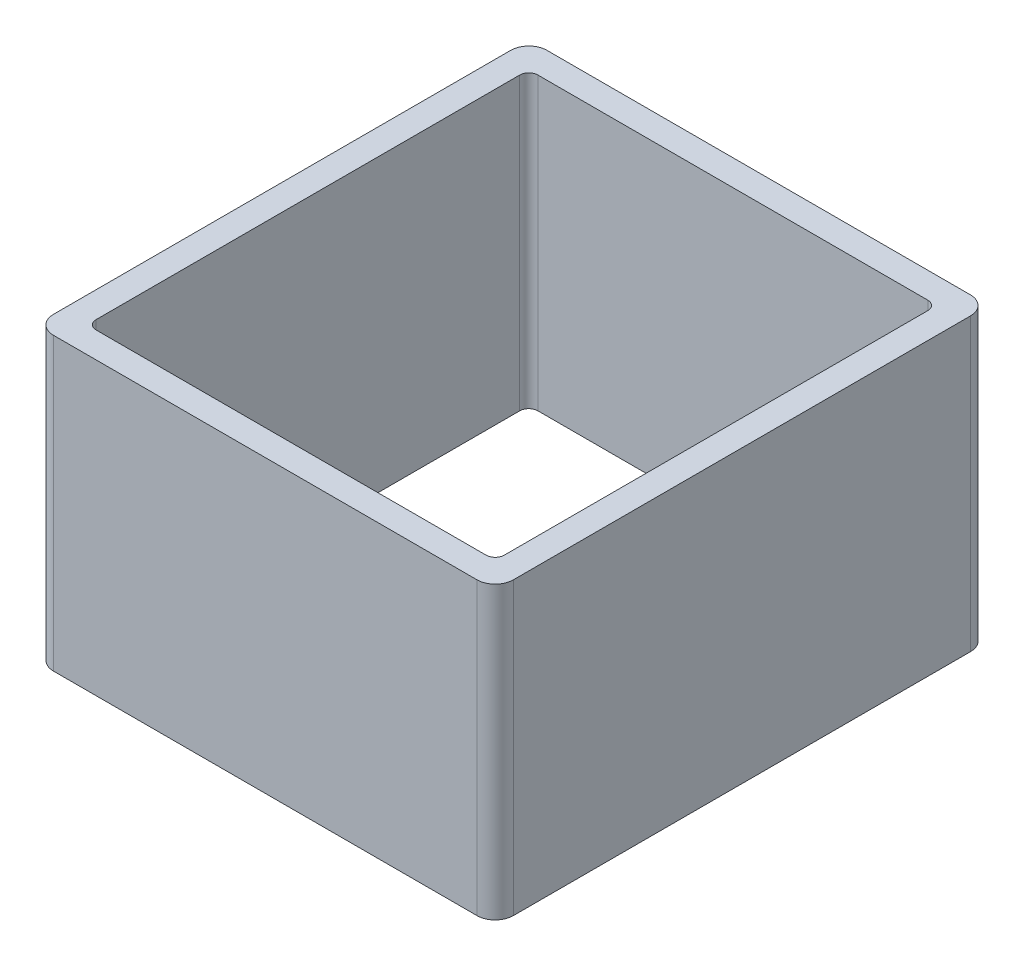
ISO-10303-21;
HEADER;
FILE_DESCRIPTION(('STEP AP214'),'2;1');
FILE_NAME('part.step','',(''),(''),'','','');
FILE_SCHEMA(('AUTOMOTIVE_DESIGN { 1 0 10303 214 1 1 1 1 }'));
ENDSEC;
DATA;
#1=APPLICATION_CONTEXT('core data for automotive mechanical design processes');
#2=APPLICATION_PROTOCOL_DEFINITION('international standard','automotive_design',2000,#1);
#3=PRODUCT_CONTEXT('',#1,'mechanical');
#4=PRODUCT('Part','Part','',(#3));
#5=PRODUCT_RELATED_PRODUCT_CATEGORY('part','',(#4));
#6=PRODUCT_DEFINITION_FORMATION('','',#4);
#7=PRODUCT_DEFINITION_CONTEXT('part definition',#1,'design');
#8=PRODUCT_DEFINITION('design','',#6,#7);
#9=PRODUCT_DEFINITION_SHAPE('','',#8);
#10=(LENGTH_UNIT() NAMED_UNIT(*) SI_UNIT(.MILLI.,.METRE.));
#11=(NAMED_UNIT(*) PLANE_ANGLE_UNIT() SI_UNIT($,.RADIAN.));
#12=(NAMED_UNIT(*) SI_UNIT($,.STERADIAN.) SOLID_ANGLE_UNIT());
#13=UNCERTAINTY_MEASURE_WITH_UNIT(LENGTH_MEASURE(1.E-05),#10,'distance_accuracy_value','');
#14=(GEOMETRIC_REPRESENTATION_CONTEXT(3) GLOBAL_UNCERTAINTY_ASSIGNED_CONTEXT((#13)) GLOBAL_UNIT_ASSIGNED_CONTEXT((#10,
#11,#12)) REPRESENTATION_CONTEXT('',''));
#15=CARTESIAN_POINT('',(0.,0.,0.));
#16=DIRECTION('',(0.,0.,1.));
#17=DIRECTION('',(1.,0.,0.));
#18=AXIS2_PLACEMENT_3D('',#15,#16,#17);
#19=CARTESIAN_POINT('',(0.,32.,0.));
#20=DIRECTION('',(0.,-1.,0.));
#21=DIRECTION('',(0.,0.,-1.));
#22=AXIS2_PLACEMENT_3D('',#19,#20,#21);
#23=PLANE('',#22);
#24=DIRECTION('',(0.,0.,-1.));
#25=VECTOR('',#24,1.);
#26=CARTESIAN_POINT('',(25.3,32.,27.15));
#27=LINE('',#26,#25);
#28=CARTESIAN_POINT('',(25.3,32.,25.15));
#29=VERTEX_POINT('',#28);
#30=CARTESIAN_POINT('',(25.3,32.,-25.15));
#31=VERTEX_POINT('',#30);
#32=EDGE_CURVE('E186',#29,#31,#27,.T.);
#33=ORIENTED_EDGE('',*,*,#32,.T.);
#34=CARTESIAN_POINT('',(23.3,32.,-25.15));
#35=DIRECTION('',(0.,-1.,0.));
#36=DIRECTION('',(0.,0.,-1.));
#37=AXIS2_PLACEMENT_3D('',#34,#35,#36);
#38=CIRCLE('',#37,2.);
#39=CARTESIAN_POINT('',(23.3,32.,-27.15));
#40=VERTEX_POINT('',#39);
#41=EDGE_CURVE('E202',#31,#40,#38,.F.);
#42=ORIENTED_EDGE('',*,*,#41,.T.);
#43=DIRECTION('',(-1.,0.,0.));
#44=VECTOR('',#43,1.);
#45=CARTESIAN_POINT('',(-25.3,32.,-27.15));
#46=LINE('',#45,#44);
#47=CARTESIAN_POINT('',(-23.3,32.,-27.15));
#48=VERTEX_POINT('',#47);
#49=EDGE_CURVE('E167',#40,#48,#46,.T.);
#50=ORIENTED_EDGE('',*,*,#49,.T.);
#51=CARTESIAN_POINT('',(-23.3,32.,-25.15));
#52=DIRECTION('',(0.,-1.,0.));
#53=DIRECTION('',(0.,0.,-1.));
#54=AXIS2_PLACEMENT_3D('',#51,#52,#53);
#55=CIRCLE('',#54,2.);
#56=CARTESIAN_POINT('',(-25.3,32.,-25.15));
#57=VERTEX_POINT('',#56);
#58=EDGE_CURVE('E196',#48,#57,#55,.F.);
#59=ORIENTED_EDGE('',*,*,#58,.T.);
#60=DIRECTION('',(0.,0.,1.));
#61=VECTOR('',#60,1.);
#62=CARTESIAN_POINT('',(-25.3,32.,27.15));
#63=LINE('',#62,#61);
#64=CARTESIAN_POINT('',(-25.3,32.,25.15));
#65=VERTEX_POINT('',#64);
#66=EDGE_CURVE('E281',#57,#65,#63,.T.);
#67=ORIENTED_EDGE('',*,*,#66,.T.);
#68=CARTESIAN_POINT('',(-23.3,32.,25.15));
#69=DIRECTION('',(0.,-1.,0.));
#70=DIRECTION('',(0.,0.,-1.));
#71=AXIS2_PLACEMENT_3D('',#68,#69,#70);
#72=CIRCLE('',#71,2.);
#73=CARTESIAN_POINT('',(-23.3,32.,27.15));
#74=VERTEX_POINT('',#73);
#75=EDGE_CURVE('E198',#65,#74,#72,.F.);
#76=ORIENTED_EDGE('',*,*,#75,.T.);
#77=DIRECTION('',(1.,0.,0.));
#78=VECTOR('',#77,1.);
#79=CARTESIAN_POINT('',(-25.3,32.,27.15));
#80=LINE('',#79,#78);
#81=CARTESIAN_POINT('',(23.3,32.,27.15));
#82=VERTEX_POINT('',#81);
#83=EDGE_CURVE('E187',#74,#82,#80,.T.);
#84=ORIENTED_EDGE('',*,*,#83,.T.);
#85=CARTESIAN_POINT('',(23.3,32.,25.15));
#86=DIRECTION('',(0.,-1.,0.));
#87=DIRECTION('',(0.,0.,-1.));
#88=AXIS2_PLACEMENT_3D('',#85,#86,#87);
#89=CIRCLE('',#88,2.);
#90=EDGE_CURVE('E200',#82,#29,#89,.F.);
#91=ORIENTED_EDGE('',*,*,#90,.T.);
#92=EDGE_LOOP('',(#33,#42,#50,#59,#67,#76,#84,#91));
#93=FACE_BOUND('',#92,.T.);
#94=DIRECTION('',(0.,0.,-1.));
#95=VECTOR('',#94,1.);
#96=CARTESIAN_POINT('',(22.45,32.,24.3));
#97=LINE('',#96,#95);
#98=CARTESIAN_POINT('',(22.45,32.,23.3));
#99=VERTEX_POINT('',#98);
#100=CARTESIAN_POINT('',(22.45,32.,-23.3));
#101=VERTEX_POINT('',#100);
#102=EDGE_CURVE('E264',#99,#101,#97,.T.);
#103=ORIENTED_EDGE('',*,*,#102,.F.);
#104=CARTESIAN_POINT('',(21.45,32.,23.3));
#105=DIRECTION('',(0.,-1.,0.));
#106=DIRECTION('',(0.,0.,-1.));
#107=AXIS2_PLACEMENT_3D('',#104,#105,#106);
#108=CIRCLE('',#107,1.);
#109=CARTESIAN_POINT('',(21.45,32.,24.3));
#110=VERTEX_POINT('',#109);
#111=EDGE_CURVE('E239',#99,#110,#108,.T.);
#112=ORIENTED_EDGE('',*,*,#111,.T.);
#113=DIRECTION('',(1.,0.,0.));
#114=VECTOR('',#113,1.);
#115=CARTESIAN_POINT('',(-22.45,32.,24.3));
#116=LINE('',#115,#114);
#117=CARTESIAN_POINT('',(-21.45,32.,24.3));
#118=VERTEX_POINT('',#117);
#119=EDGE_CURVE('E180',#118,#110,#116,.T.);
#120=ORIENTED_EDGE('',*,*,#119,.F.);
#121=CARTESIAN_POINT('',(-21.45,32.,23.3));
#122=DIRECTION('',(0.,-1.,0.));
#123=DIRECTION('',(0.,0.,-1.));
#124=AXIS2_PLACEMENT_3D('',#121,#122,#123);
#125=CIRCLE('',#124,1.);
#126=CARTESIAN_POINT('',(-22.45,32.,23.3));
#127=VERTEX_POINT('',#126);
#128=EDGE_CURVE('E48',#118,#127,#125,.T.);
#129=ORIENTED_EDGE('',*,*,#128,.T.);
#130=DIRECTION('',(0.,0.,1.));
#131=VECTOR('',#130,1.);
#132=CARTESIAN_POINT('',(-22.45,32.,24.3));
#133=LINE('',#132,#131);
#134=CARTESIAN_POINT('',(-22.45,32.,-23.3));
#135=VERTEX_POINT('',#134);
#136=EDGE_CURVE('E260',#135,#127,#133,.T.);
#137=ORIENTED_EDGE('',*,*,#136,.F.);
#138=CARTESIAN_POINT('',(-21.45,32.,-23.3));
#139=DIRECTION('',(0.,-1.,0.));
#140=DIRECTION('',(0.,0.,-1.));
#141=AXIS2_PLACEMENT_3D('',#138,#139,#140);
#142=CIRCLE('',#141,1.);
#143=CARTESIAN_POINT('',(-21.45,32.,-24.3));
#144=VERTEX_POINT('',#143);
#145=EDGE_CURVE('E11',#135,#144,#142,.T.);
#146=ORIENTED_EDGE('',*,*,#145,.T.);
#147=DIRECTION('',(-1.,0.,0.));
#148=VECTOR('',#147,1.);
#149=CARTESIAN_POINT('',(-22.45,32.,-24.3));
#150=LINE('',#149,#148);
#151=CARTESIAN_POINT('',(21.45,32.,-24.3));
#152=VERTEX_POINT('',#151);
#153=EDGE_CURVE('E258',#152,#144,#150,.T.);
#154=ORIENTED_EDGE('',*,*,#153,.F.);
#155=CARTESIAN_POINT('',(21.45,32.,-23.3));
#156=DIRECTION('',(0.,-1.,0.));
#157=DIRECTION('',(0.,0.,-1.));
#158=AXIS2_PLACEMENT_3D('',#155,#156,#157);
#159=CIRCLE('',#158,1.);
#160=EDGE_CURVE('E235',#152,#101,#159,.T.);
#161=ORIENTED_EDGE('',*,*,#160,.T.);
#162=EDGE_LOOP('',(#103,#112,#120,#129,#137,#146,#154,#161));
#163=FACE_BOUND('',#162,.T.);
#164=ADVANCED_FACE('F33',(#93,#163),#23,.F.);
#165=CARTESIAN_POINT('',(0.,0.,0.));
#166=DIRECTION('',(0.,-1.,0.));
#167=DIRECTION('',(0.,0.,-1.));
#168=AXIS2_PLACEMENT_3D('',#165,#166,#167);
#169=PLANE('',#168);
#170=DIRECTION('',(-1.,0.,0.));
#171=VECTOR('',#170,1.);
#172=CARTESIAN_POINT('',(-25.3,0.,-27.15));
#173=LINE('',#172,#171);
#174=CARTESIAN_POINT('',(23.3,0.,-27.15));
#175=VERTEX_POINT('',#174);
#176=CARTESIAN_POINT('',(-23.3,0.,-27.15));
#177=VERTEX_POINT('',#176);
#178=EDGE_CURVE('E164',#175,#177,#173,.T.);
#179=ORIENTED_EDGE('',*,*,#178,.F.);
#180=CARTESIAN_POINT('',(23.3,0.,-25.15));
#181=DIRECTION('',(0.,-1.,0.));
#182=DIRECTION('',(0.,0.,-1.));
#183=AXIS2_PLACEMENT_3D('',#180,#181,#182);
#184=CIRCLE('',#183,2.);
#185=CARTESIAN_POINT('',(25.3,0.,-25.15));
#186=VERTEX_POINT('',#185);
#187=EDGE_CURVE('E147',#175,#186,#184,.T.);
#188=ORIENTED_EDGE('',*,*,#187,.T.);
#189=DIRECTION('',(0.,0.,-1.));
#190=VECTOR('',#189,1.);
#191=CARTESIAN_POINT('',(25.3,0.,27.15));
#192=LINE('',#191,#190);
#193=CARTESIAN_POINT('',(25.3,0.,25.15));
#194=VERTEX_POINT('',#193);
#195=EDGE_CURVE('E175',#194,#186,#192,.T.);
#196=ORIENTED_EDGE('',*,*,#195,.F.);
#197=CARTESIAN_POINT('',(23.3,0.,25.15));
#198=DIRECTION('',(0.,-1.,0.));
#199=DIRECTION('',(0.,0.,-1.));
#200=AXIS2_PLACEMENT_3D('',#197,#198,#199);
#201=CIRCLE('',#200,2.);
#202=CARTESIAN_POINT('',(23.3,0.,27.15));
#203=VERTEX_POINT('',#202);
#204=EDGE_CURVE('E158',#194,#203,#201,.T.);
#205=ORIENTED_EDGE('',*,*,#204,.T.);
#206=DIRECTION('',(1.,0.,0.));
#207=VECTOR('',#206,1.);
#208=CARTESIAN_POINT('',(-25.3,0.,27.15));
#209=LINE('',#208,#207);
#210=CARTESIAN_POINT('',(-23.3,0.,27.15));
#211=VERTEX_POINT('',#210);
#212=EDGE_CURVE('E178',#211,#203,#209,.T.);
#213=ORIENTED_EDGE('',*,*,#212,.F.);
#214=CARTESIAN_POINT('',(-23.3,0.,25.15));
#215=DIRECTION('',(0.,-1.,0.));
#216=DIRECTION('',(0.,0.,-1.));
#217=AXIS2_PLACEMENT_3D('',#214,#215,#216);
#218=CIRCLE('',#217,2.);
#219=CARTESIAN_POINT('',(-25.3,0.,25.15));
#220=VERTEX_POINT('',#219);
#221=EDGE_CURVE('E190',#211,#220,#218,.T.);
#222=ORIENTED_EDGE('',*,*,#221,.T.);
#223=DIRECTION('',(0.,0.,1.));
#224=VECTOR('',#223,1.);
#225=CARTESIAN_POINT('',(-25.3,0.,27.15));
#226=LINE('',#225,#224);
#227=CARTESIAN_POINT('',(-25.3,0.,-25.15));
#228=VERTEX_POINT('',#227);
#229=EDGE_CURVE('E174',#228,#220,#226,.T.);
#230=ORIENTED_EDGE('',*,*,#229,.F.);
#231=CARTESIAN_POINT('',(-23.3,0.,-25.15));
#232=DIRECTION('',(0.,-1.,0.));
#233=DIRECTION('',(0.,0.,-1.));
#234=AXIS2_PLACEMENT_3D('',#231,#232,#233);
#235=CIRCLE('',#234,2.);
#236=EDGE_CURVE('E168',#228,#177,#235,.T.);
#237=ORIENTED_EDGE('',*,*,#236,.T.);
#238=EDGE_LOOP('',(#179,#188,#196,#205,#213,#222,#230,#237));
#239=FACE_BOUND('',#238,.T.);
#240=DIRECTION('',(0.,0.,1.));
#241=VECTOR('',#240,1.);
#242=CARTESIAN_POINT('',(-22.45,0.,24.3));
#243=LINE('',#242,#241);
#244=CARTESIAN_POINT('',(-22.45,0.,-23.3));
#245=VERTEX_POINT('',#244);
#246=CARTESIAN_POINT('',(-22.45,0.,23.3));
#247=VERTEX_POINT('',#246);
#248=EDGE_CURVE('E245',#245,#247,#243,.T.);
#249=ORIENTED_EDGE('',*,*,#248,.T.);
#250=CARTESIAN_POINT('',(-21.45,0.,23.3));
#251=DIRECTION('',(0.,-1.,0.));
#252=DIRECTION('',(0.,0.,-1.));
#253=AXIS2_PLACEMENT_3D('',#250,#251,#252);
#254=CIRCLE('',#253,1.);
#255=CARTESIAN_POINT('',(-21.45,0.,24.3));
#256=VERTEX_POINT('',#255);
#257=EDGE_CURVE('E241',#247,#256,#254,.F.);
#258=ORIENTED_EDGE('',*,*,#257,.T.);
#259=DIRECTION('',(1.,0.,0.));
#260=VECTOR('',#259,1.);
#261=CARTESIAN_POINT('',(-22.45,0.,24.3));
#262=LINE('',#261,#260);
#263=CARTESIAN_POINT('',(21.45,0.,24.3));
#264=VERTEX_POINT('',#263);
#265=EDGE_CURVE('E252',#256,#264,#262,.T.);
#266=ORIENTED_EDGE('',*,*,#265,.T.);
#267=CARTESIAN_POINT('',(21.45,0.,23.3));
#268=DIRECTION('',(0.,-1.,0.));
#269=DIRECTION('',(0.,0.,-1.));
#270=AXIS2_PLACEMENT_3D('',#267,#268,#269);
#271=CIRCLE('',#270,1.);
#272=CARTESIAN_POINT('',(22.45,0.,23.3));
#273=VERTEX_POINT('',#272);
#274=EDGE_CURVE('E237',#264,#273,#271,.F.);
#275=ORIENTED_EDGE('',*,*,#274,.T.);
#276=DIRECTION('',(0.,0.,-1.));
#277=VECTOR('',#276,1.);
#278=CARTESIAN_POINT('',(22.45,0.,24.3));
#279=LINE('',#278,#277);
#280=CARTESIAN_POINT('',(22.45,0.,-23.3));
#281=VERTEX_POINT('',#280);
#282=EDGE_CURVE('E272',#273,#281,#279,.T.);
#283=ORIENTED_EDGE('',*,*,#282,.T.);
#284=CARTESIAN_POINT('',(21.45,0.,-23.3));
#285=DIRECTION('',(0.,-1.,0.));
#286=DIRECTION('',(0.,0.,-1.));
#287=AXIS2_PLACEMENT_3D('',#284,#285,#286);
#288=CIRCLE('',#287,1.);
#289=CARTESIAN_POINT('',(21.45,0.,-24.3));
#290=VERTEX_POINT('',#289);
#291=EDGE_CURVE('E233',#281,#290,#288,.F.);
#292=ORIENTED_EDGE('',*,*,#291,.T.);
#293=DIRECTION('',(-1.,0.,0.));
#294=VECTOR('',#293,1.);
#295=CARTESIAN_POINT('',(-22.45,0.,-24.3));
#296=LINE('',#295,#294);
#297=CARTESIAN_POINT('',(-21.45,0.,-24.3));
#298=VERTEX_POINT('',#297);
#299=EDGE_CURVE('E247',#290,#298,#296,.T.);
#300=ORIENTED_EDGE('',*,*,#299,.T.);
#301=CARTESIAN_POINT('',(-21.45,0.,-23.3));
#302=DIRECTION('',(0.,-1.,0.));
#303=DIRECTION('',(0.,0.,-1.));
#304=AXIS2_PLACEMENT_3D('',#301,#302,#303);
#305=CIRCLE('',#304,1.);
#306=EDGE_CURVE('E41',#298,#245,#305,.F.);
#307=ORIENTED_EDGE('',*,*,#306,.T.);
#308=EDGE_LOOP('',(#249,#258,#266,#275,#283,#292,#300,#307));
#309=FACE_BOUND('',#308,.T.);
#310=ADVANCED_FACE('F171',(#239,#309),#169,.T.);
#311=CARTESIAN_POINT('',(25.3,32.,27.15));
#312=DIRECTION('',(-1.,0.,0.));
#313=DIRECTION('',(0.,0.,1.));
#314=AXIS2_PLACEMENT_3D('',#311,#312,#313);
#315=PLANE('',#314);
#316=ORIENTED_EDGE('',*,*,#195,.T.);
#317=DIRECTION('',(0.,-1.,0.));
#318=VECTOR('',#317,1.);
#319=CARTESIAN_POINT('',(25.3,32.,-25.15));
#320=LINE('',#319,#318);
#321=EDGE_CURVE('E152',#186,#31,#320,.F.);
#322=ORIENTED_EDGE('',*,*,#321,.T.);
#323=ORIENTED_EDGE('',*,*,#32,.F.);
#324=DIRECTION('',(0.,-1.,0.));
#325=VECTOR('',#324,1.);
#326=CARTESIAN_POINT('',(25.3,32.,25.15));
#327=LINE('',#326,#325);
#328=EDGE_CURVE('E157',#29,#194,#327,.T.);
#329=ORIENTED_EDGE('',*,*,#328,.T.);
#330=EDGE_LOOP('',(#316,#322,#323,#329));
#331=FACE_BOUND('',#330,.T.);
#332=ADVANCED_FACE('F296',(#331),#315,.F.);
#333=CARTESIAN_POINT('',(-25.3,32.,-27.15));
#334=DIRECTION('',(0.,0.,1.));
#335=DIRECTION('',(1.,0.,0.));
#336=AXIS2_PLACEMENT_3D('',#333,#334,#335);
#337=PLANE('',#336);
#338=ORIENTED_EDGE('',*,*,#49,.F.);
#339=DIRECTION('',(0.,-1.,0.));
#340=VECTOR('',#339,1.);
#341=CARTESIAN_POINT('',(23.3,32.,-27.15));
#342=LINE('',#341,#340);
#343=EDGE_CURVE('E151',#40,#175,#342,.T.);
#344=ORIENTED_EDGE('',*,*,#343,.T.);
#345=ORIENTED_EDGE('',*,*,#178,.T.);
#346=DIRECTION('',(0.,-1.,0.));
#347=VECTOR('',#346,1.);
#348=CARTESIAN_POINT('',(-23.3,32.,-27.15));
#349=LINE('',#348,#347);
#350=EDGE_CURVE('E169',#177,#48,#349,.F.);
#351=ORIENTED_EDGE('',*,*,#350,.T.);
#352=EDGE_LOOP('',(#338,#344,#345,#351));
#353=FACE_BOUND('',#352,.T.);
#354=ADVANCED_FACE('F163',(#353),#337,.F.);
#355=CARTESIAN_POINT('',(-25.3,32.,27.15));
#356=DIRECTION('',(1.,0.,0.));
#357=DIRECTION('',(0.,0.,-1.));
#358=AXIS2_PLACEMENT_3D('',#355,#356,#357);
#359=PLANE('',#358);
#360=ORIENTED_EDGE('',*,*,#229,.T.);
#361=DIRECTION('',(0.,-1.,0.));
#362=VECTOR('',#361,1.);
#363=CARTESIAN_POINT('',(-25.3,32.,25.15));
#364=LINE('',#363,#362);
#365=EDGE_CURVE('E212',#220,#65,#364,.F.);
#366=ORIENTED_EDGE('',*,*,#365,.T.);
#367=ORIENTED_EDGE('',*,*,#66,.F.);
#368=DIRECTION('',(0.,-1.,0.));
#369=VECTOR('',#368,1.);
#370=CARTESIAN_POINT('',(-25.3,32.,-25.15));
#371=LINE('',#370,#369);
#372=EDGE_CURVE('E209',#57,#228,#371,.T.);
#373=ORIENTED_EDGE('',*,*,#372,.T.);
#374=EDGE_LOOP('',(#360,#366,#367,#373));
#375=FACE_BOUND('',#374,.T.);
#376=ADVANCED_FACE('F303',(#375),#359,.F.);
#377=CARTESIAN_POINT('',(-25.3,32.,27.15));
#378=DIRECTION('',(0.,0.,-1.));
#379=DIRECTION('',(-1.,0.,0.));
#380=AXIS2_PLACEMENT_3D('',#377,#378,#379);
#381=PLANE('',#380);
#382=ORIENTED_EDGE('',*,*,#212,.T.);
#383=DIRECTION('',(0.,-1.,0.));
#384=VECTOR('',#383,1.);
#385=CARTESIAN_POINT('',(23.3,32.,27.15));
#386=LINE('',#385,#384);
#387=EDGE_CURVE('E207',#203,#82,#386,.F.);
#388=ORIENTED_EDGE('',*,*,#387,.T.);
#389=ORIENTED_EDGE('',*,*,#83,.F.);
#390=DIRECTION('',(0.,-1.,0.));
#391=VECTOR('',#390,1.);
#392=CARTESIAN_POINT('',(-23.3,32.,27.15));
#393=LINE('',#392,#391);
#394=EDGE_CURVE('E204',#74,#211,#393,.T.);
#395=ORIENTED_EDGE('',*,*,#394,.T.);
#396=EDGE_LOOP('',(#382,#388,#389,#395));
#397=FACE_BOUND('',#396,.T.);
#398=ADVANCED_FACE('F298',(#397),#381,.F.);
#399=CARTESIAN_POINT('',(22.45,32.,24.3));
#400=DIRECTION('',(-1.,0.,0.));
#401=DIRECTION('',(0.,0.,1.));
#402=AXIS2_PLACEMENT_3D('',#399,#400,#401);
#403=PLANE('',#402);
#404=ORIENTED_EDGE('',*,*,#102,.T.);
#405=DIRECTION('',(0.,-1.,0.));
#406=VECTOR('',#405,1.);
#407=CARTESIAN_POINT('',(22.45,0.,-23.3));
#408=LINE('',#407,#406);
#409=EDGE_CURVE('E216',#101,#281,#408,.T.);
#410=ORIENTED_EDGE('',*,*,#409,.T.);
#411=ORIENTED_EDGE('',*,*,#282,.F.);
#412=DIRECTION('',(0.,-1.,0.));
#413=VECTOR('',#412,1.);
#414=CARTESIAN_POINT('',(22.45,32.,23.3));
#415=LINE('',#414,#413);
#416=EDGE_CURVE('E214',#273,#99,#415,.F.);
#417=ORIENTED_EDGE('',*,*,#416,.T.);
#418=EDGE_LOOP('',(#404,#410,#411,#417));
#419=FACE_BOUND('',#418,.T.);
#420=ADVANCED_FACE('F327',(#419),#403,.T.);
#421=CARTESIAN_POINT('',(-22.45,32.,-24.3));
#422=DIRECTION('',(0.,0.,1.));
#423=DIRECTION('',(1.,0.,0.));
#424=AXIS2_PLACEMENT_3D('',#421,#422,#423);
#425=PLANE('',#424);
#426=ORIENTED_EDGE('',*,*,#299,.F.);
#427=DIRECTION('',(0.,-1.,0.));
#428=VECTOR('',#427,1.);
#429=CARTESIAN_POINT('',(21.45,32.,-24.3));
#430=LINE('',#429,#428);
#431=EDGE_CURVE('E222',#290,#152,#430,.F.);
#432=ORIENTED_EDGE('',*,*,#431,.T.);
#433=ORIENTED_EDGE('',*,*,#153,.T.);
#434=DIRECTION('',(0.,-1.,0.));
#435=VECTOR('',#434,1.);
#436=CARTESIAN_POINT('',(-21.45,0.,-24.3));
#437=LINE('',#436,#435);
#438=EDGE_CURVE('E219',#144,#298,#437,.T.);
#439=ORIENTED_EDGE('',*,*,#438,.T.);
#440=EDGE_LOOP('',(#426,#432,#433,#439));
#441=FACE_BOUND('',#440,.T.);
#442=ADVANCED_FACE('F262',(#441),#425,.T.);
#443=CARTESIAN_POINT('',(-22.45,32.,24.3));
#444=DIRECTION('',(1.,0.,0.));
#445=DIRECTION('',(0.,0.,-1.));
#446=AXIS2_PLACEMENT_3D('',#443,#444,#445);
#447=PLANE('',#446);
#448=ORIENTED_EDGE('',*,*,#136,.T.);
#449=DIRECTION('',(0.,-1.,0.));
#450=VECTOR('',#449,1.);
#451=CARTESIAN_POINT('',(-22.45,0.,23.3));
#452=LINE('',#451,#450);
#453=EDGE_CURVE('E230',#127,#247,#452,.T.);
#454=ORIENTED_EDGE('',*,*,#453,.T.);
#455=ORIENTED_EDGE('',*,*,#248,.F.);
#456=DIRECTION('',(0.,-1.,0.));
#457=VECTOR('',#456,1.);
#458=CARTESIAN_POINT('',(-22.45,32.,-23.3));
#459=LINE('',#458,#457);
#460=EDGE_CURVE('E55',#245,#135,#459,.F.);
#461=ORIENTED_EDGE('',*,*,#460,.T.);
#462=EDGE_LOOP('',(#448,#454,#455,#461));
#463=FACE_BOUND('',#462,.T.);
#464=ADVANCED_FACE('F250',(#463),#447,.T.);
#465=CARTESIAN_POINT('',(-22.45,32.,24.3));
#466=DIRECTION('',(0.,0.,-1.));
#467=DIRECTION('',(-1.,0.,0.));
#468=AXIS2_PLACEMENT_3D('',#465,#466,#467);
#469=PLANE('',#468);
#470=ORIENTED_EDGE('',*,*,#119,.T.);
#471=DIRECTION('',(0.,-1.,0.));
#472=VECTOR('',#471,1.);
#473=CARTESIAN_POINT('',(21.45,0.,24.3));
#474=LINE('',#473,#472);
#475=EDGE_CURVE('E226',#110,#264,#474,.T.);
#476=ORIENTED_EDGE('',*,*,#475,.T.);
#477=ORIENTED_EDGE('',*,*,#265,.F.);
#478=DIRECTION('',(0.,-1.,0.));
#479=VECTOR('',#478,1.);
#480=CARTESIAN_POINT('',(-21.45,32.,24.3));
#481=LINE('',#480,#479);
#482=EDGE_CURVE('E224',#256,#118,#481,.F.);
#483=ORIENTED_EDGE('',*,*,#482,.T.);
#484=EDGE_LOOP('',(#470,#476,#477,#483));
#485=FACE_BOUND('',#484,.T.);
#486=ADVANCED_FACE('F340',(#485),#469,.T.);
#487=CARTESIAN_POINT('',(23.3,32.,-25.15));
#488=DIRECTION('',(0.,-1.,0.));
#489=DIRECTION('',(0.,0.,-1.));
#490=AXIS2_PLACEMENT_3D('',#487,#488,#489);
#491=CYLINDRICAL_SURFACE('',#490,2.);
#492=ORIENTED_EDGE('',*,*,#41,.F.);
#493=ORIENTED_EDGE('',*,*,#321,.F.);
#494=ORIENTED_EDGE('',*,*,#187,.F.);
#495=ORIENTED_EDGE('',*,*,#343,.F.);
#496=EDGE_LOOP('',(#492,#493,#494,#495));
#497=FACE_BOUND('',#496,.T.);
#498=ADVANCED_FACE('F150',(#497),#491,.T.);
#499=CARTESIAN_POINT('',(23.3,32.,25.15));
#500=DIRECTION('',(0.,-1.,0.));
#501=DIRECTION('',(0.,0.,-1.));
#502=AXIS2_PLACEMENT_3D('',#499,#500,#501);
#503=CYLINDRICAL_SURFACE('',#502,2.);
#504=ORIENTED_EDGE('',*,*,#90,.F.);
#505=ORIENTED_EDGE('',*,*,#387,.F.);
#506=ORIENTED_EDGE('',*,*,#204,.F.);
#507=ORIENTED_EDGE('',*,*,#328,.F.);
#508=EDGE_LOOP('',(#504,#505,#506,#507));
#509=FACE_BOUND('',#508,.T.);
#510=ADVANCED_FACE('F294',(#509),#503,.T.);
#511=CARTESIAN_POINT('',(-23.3,32.,25.15));
#512=DIRECTION('',(0.,-1.,0.));
#513=DIRECTION('',(0.,0.,-1.));
#514=AXIS2_PLACEMENT_3D('',#511,#512,#513);
#515=CYLINDRICAL_SURFACE('',#514,2.);
#516=ORIENTED_EDGE('',*,*,#75,.F.);
#517=ORIENTED_EDGE('',*,*,#365,.F.);
#518=ORIENTED_EDGE('',*,*,#221,.F.);
#519=ORIENTED_EDGE('',*,*,#394,.F.);
#520=EDGE_LOOP('',(#516,#517,#518,#519));
#521=FACE_BOUND('',#520,.T.);
#522=ADVANCED_FACE('F300',(#521),#515,.T.);
#523=CARTESIAN_POINT('',(-23.3,32.,-25.15));
#524=DIRECTION('',(0.,-1.,0.));
#525=DIRECTION('',(0.,0.,-1.));
#526=AXIS2_PLACEMENT_3D('',#523,#524,#525);
#527=CYLINDRICAL_SURFACE('',#526,2.);
#528=ORIENTED_EDGE('',*,*,#58,.F.);
#529=ORIENTED_EDGE('',*,*,#350,.F.);
#530=ORIENTED_EDGE('',*,*,#236,.F.);
#531=ORIENTED_EDGE('',*,*,#372,.F.);
#532=EDGE_LOOP('',(#528,#529,#530,#531));
#533=FACE_BOUND('',#532,.T.);
#534=ADVANCED_FACE('F308',(#533),#527,.T.);
#535=CARTESIAN_POINT('',(21.45,32.,-23.3));
#536=DIRECTION('',(0.,1.,0.));
#537=DIRECTION('',(0.,0.,1.));
#538=AXIS2_PLACEMENT_3D('',#535,#536,#537);
#539=CYLINDRICAL_SURFACE('',#538,1.);
#540=ORIENTED_EDGE('',*,*,#160,.F.);
#541=ORIENTED_EDGE('',*,*,#431,.F.);
#542=ORIENTED_EDGE('',*,*,#291,.F.);
#543=ORIENTED_EDGE('',*,*,#409,.F.);
#544=EDGE_LOOP('',(#540,#541,#542,#543));
#545=FACE_BOUND('',#544,.T.);
#546=ADVANCED_FACE('F310',(#545),#539,.F.);
#547=CARTESIAN_POINT('',(21.45,32.,23.3));
#548=DIRECTION('',(0.,1.,0.));
#549=DIRECTION('',(0.,0.,1.));
#550=AXIS2_PLACEMENT_3D('',#547,#548,#549);
#551=CYLINDRICAL_SURFACE('',#550,1.);
#552=ORIENTED_EDGE('',*,*,#111,.F.);
#553=ORIENTED_EDGE('',*,*,#416,.F.);
#554=ORIENTED_EDGE('',*,*,#274,.F.);
#555=ORIENTED_EDGE('',*,*,#475,.F.);
#556=EDGE_LOOP('',(#552,#553,#554,#555));
#557=FACE_BOUND('',#556,.T.);
#558=ADVANCED_FACE('F316',(#557),#551,.F.);
#559=CARTESIAN_POINT('',(-21.45,32.,23.3));
#560=DIRECTION('',(0.,1.,0.));
#561=DIRECTION('',(0.,0.,1.));
#562=AXIS2_PLACEMENT_3D('',#559,#560,#561);
#563=CYLINDRICAL_SURFACE('',#562,1.);
#564=ORIENTED_EDGE('',*,*,#128,.F.);
#565=ORIENTED_EDGE('',*,*,#482,.F.);
#566=ORIENTED_EDGE('',*,*,#257,.F.);
#567=ORIENTED_EDGE('',*,*,#453,.F.);
#568=EDGE_LOOP('',(#564,#565,#566,#567));
#569=FACE_BOUND('',#568,.T.);
#570=ADVANCED_FACE('F414',(#569),#563,.F.);
#571=CARTESIAN_POINT('',(-21.45,32.,-23.3));
#572=DIRECTION('',(0.,1.,0.));
#573=DIRECTION('',(0.,0.,1.));
#574=AXIS2_PLACEMENT_3D('',#571,#572,#573);
#575=CYLINDRICAL_SURFACE('',#574,1.);
#576=ORIENTED_EDGE('',*,*,#145,.F.);
#577=ORIENTED_EDGE('',*,*,#460,.F.);
#578=ORIENTED_EDGE('',*,*,#306,.F.);
#579=ORIENTED_EDGE('',*,*,#438,.F.);
#580=EDGE_LOOP('',(#576,#577,#578,#579));
#581=FACE_BOUND('',#580,.T.);
#582=ADVANCED_FACE('F35',(#581),#575,.F.);
#583=CLOSED_SHELL('',(#164,#310,#332,#354,#376,#398,#420,#442,#464,#486,#498,#510,#522,#534,
#546,#558,#570,#582));
#584=MANIFOLD_SOLID_BREP('B2',#583);
#585=ADVANCED_BREP_SHAPE_REPRESENTATION('',(#18,#584),#14);
#586=SHAPE_DEFINITION_REPRESENTATION(#9,#585);
ENDSEC;
END-ISO-10303-21;
